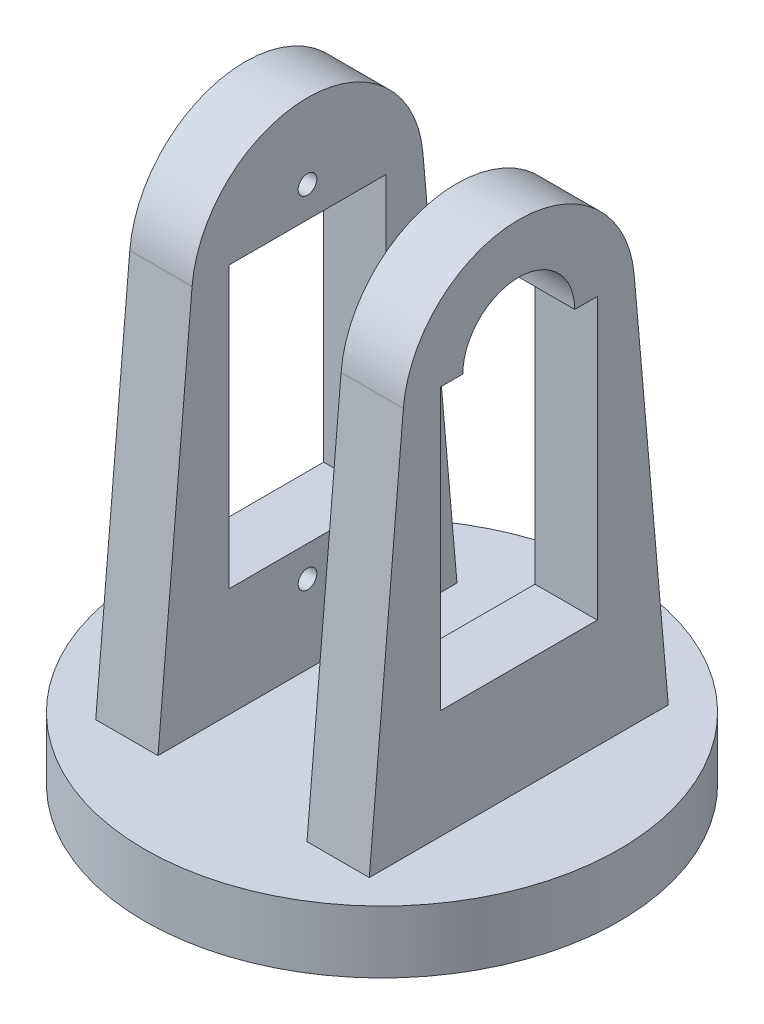
ISO-10303-21;
HEADER;
FILE_DESCRIPTION(('STEP AP214'),'2;1');
FILE_NAME('part.step','',(''),(''),'','','');
FILE_SCHEMA(('AUTOMOTIVE_DESIGN { 1 0 10303 214 1 1 1 1 }'));
ENDSEC;
DATA;
#1=APPLICATION_CONTEXT('core data for automotive mechanical design processes');
#2=APPLICATION_PROTOCOL_DEFINITION('international standard','automotive_design',2000,#1);
#3=PRODUCT_CONTEXT('',#1,'mechanical');
#4=PRODUCT('Part','Part','',(#3));
#5=PRODUCT_RELATED_PRODUCT_CATEGORY('part','',(#4));
#6=PRODUCT_DEFINITION_FORMATION('','',#4);
#7=PRODUCT_DEFINITION_CONTEXT('part definition',#1,'design');
#8=PRODUCT_DEFINITION('design','',#6,#7);
#9=PRODUCT_DEFINITION_SHAPE('','',#8);
#10=(LENGTH_UNIT() NAMED_UNIT(*) SI_UNIT(.MILLI.,.METRE.));
#11=(NAMED_UNIT(*) PLANE_ANGLE_UNIT() SI_UNIT($,.RADIAN.));
#12=(NAMED_UNIT(*) SI_UNIT($,.STERADIAN.) SOLID_ANGLE_UNIT());
#13=UNCERTAINTY_MEASURE_WITH_UNIT(LENGTH_MEASURE(1.E-05),#10,'distance_accuracy_value','');
#14=(GEOMETRIC_REPRESENTATION_CONTEXT(3) GLOBAL_UNCERTAINTY_ASSIGNED_CONTEXT((#13)) GLOBAL_UNIT_ASSIGNED_CONTEXT((#10,
#11,#12)) REPRESENTATION_CONTEXT('',''));
#15=CARTESIAN_POINT('',(0.,0.,0.));
#16=DIRECTION('',(0.,0.,1.));
#17=DIRECTION('',(1.,0.,0.));
#18=AXIS2_PLACEMENT_3D('',#15,#16,#17);
#19=CARTESIAN_POINT('',(5.98,36.25,-6.3));
#20=DIRECTION('',(0.,-1.,0.));
#21=DIRECTION('',(0.,0.,-1.));
#22=AXIS2_PLACEMENT_3D('',#19,#20,#21);
#23=PLANE('',#22);
#24=DIRECTION('',(-1.,0.,0.));
#25=VECTOR('',#24,1.);
#26=CARTESIAN_POINT('',(21.0215231185642,36.25,4.49070565814904));
#27=LINE('',#26,#25);
#28=CARTESIAN_POINT('',(10.98,36.25,4.49070565814904));
#29=VERTEX_POINT('',#28);
#30=CARTESIAN_POINT('',(5.98,36.25,4.49070565814904));
#31=VERTEX_POINT('',#30);
#32=EDGE_CURVE('E204',#29,#31,#27,.T.);
#33=ORIENTED_EDGE('',*,*,#32,.F.);
#34=DIRECTION('',(0.,0.,-1.));
#35=VECTOR('',#34,1.);
#36=CARTESIAN_POINT('',(10.98,36.25,-6.3));
#37=LINE('',#36,#35);
#38=CARTESIAN_POINT('',(10.98,36.25,6.3));
#39=VERTEX_POINT('',#38);
#40=EDGE_CURVE('E246',#39,#29,#37,.T.);
#41=ORIENTED_EDGE('',*,*,#40,.F.);
#42=DIRECTION('',(1.,0.,0.));
#43=VECTOR('',#42,1.);
#44=CARTESIAN_POINT('',(5.98,36.25,6.3));
#45=LINE('',#44,#43);
#46=CARTESIAN_POINT('',(5.98,36.25,6.3));
#47=VERTEX_POINT('',#46);
#48=EDGE_CURVE('E225',#47,#39,#45,.T.);
#49=ORIENTED_EDGE('',*,*,#48,.F.);
#50=DIRECTION('',(0.,0.,-1.));
#51=VECTOR('',#50,1.);
#52=CARTESIAN_POINT('',(5.98,36.25,-6.3));
#53=LINE('',#52,#51);
#54=EDGE_CURVE('E219',#47,#31,#53,.T.);
#55=ORIENTED_EDGE('',*,*,#54,.T.);
#56=EDGE_LOOP('',(#33,#41,#49,#55));
#57=FACE_BOUND('',#56,.T.);
#58=ADVANCED_FACE('F43',(#57),#23,.T.);
#59=CARTESIAN_POINT('',(0.,5.,0.));
#60=DIRECTION('',(0.,1.,0.));
#61=DIRECTION('',(0.,0.,1.));
#62=AXIS2_PLACEMENT_3D('',#59,#60,#61);
#63=PLANE('',#62);
#64=DIRECTION('',(0.,0.,1.));
#65=VECTOR('',#64,1.);
#66=CARTESIAN_POINT('',(-5.98,5.,-12.));
#67=LINE('',#66,#65);
#68=CARTESIAN_POINT('',(-5.98,5.,-12.));
#69=VERTEX_POINT('',#68);
#70=CARTESIAN_POINT('',(-5.98,5.,12.));
#71=VERTEX_POINT('',#70);
#72=EDGE_CURVE('E318',#69,#71,#67,.T.);
#73=ORIENTED_EDGE('',*,*,#72,.T.);
#74=DIRECTION('',(-1.,0.,0.));
#75=VECTOR('',#74,1.);
#76=CARTESIAN_POINT('',(-5.98,5.,12.));
#77=LINE('',#76,#75);
#78=CARTESIAN_POINT('',(-10.98,5.,12.));
#79=VERTEX_POINT('',#78);
#80=EDGE_CURVE('E343',#71,#79,#77,.T.);
#81=ORIENTED_EDGE('',*,*,#80,.T.);
#82=DIRECTION('',(0.,0.,1.));
#83=VECTOR('',#82,1.);
#84=CARTESIAN_POINT('',(-10.98,5.,-12.));
#85=LINE('',#84,#83);
#86=CARTESIAN_POINT('',(-10.98,5.,-12.));
#87=VERTEX_POINT('',#86);
#88=EDGE_CURVE('E330',#87,#79,#85,.T.);
#89=ORIENTED_EDGE('',*,*,#88,.F.);
#90=DIRECTION('',(-1.,0.,0.));
#91=VECTOR('',#90,1.);
#92=CARTESIAN_POINT('',(-5.98,5.,-12.));
#93=LINE('',#92,#91);
#94=EDGE_CURVE('E328',#69,#87,#93,.T.);
#95=ORIENTED_EDGE('',*,*,#94,.F.);
#96=EDGE_LOOP('',(#73,#81,#89,#95));
#97=FACE_BOUND('',#96,.T.);
#98=CARTESIAN_POINT('',(0.,5.,0.));
#99=DIRECTION('',(0.,1.,0.));
#100=DIRECTION('',(0.,0.,1.));
#101=AXIS2_PLACEMENT_3D('',#98,#99,#100);
#102=CIRCLE('',#101,19.05);
#103=CARTESIAN_POINT('',(0.,5.,19.05));
#104=VERTEX_POINT('',#103);
#105=EDGE_CURVE('E11',#104,#104,#102,.T.);
#106=ORIENTED_EDGE('',*,*,#105,.T.);
#107=EDGE_LOOP('',(#106));
#108=FACE_BOUND('',#107,.T.);
#109=CARTESIAN_POINT('',(0.,5.,0.));
#110=DIRECTION('',(0.,1.,0.));
#111=DIRECTION('',(0.,0.,1.));
#112=AXIS2_PLACEMENT_3D('',#109,#110,#111);
#113=CIRCLE('',#112,2.75);
#114=CARTESIAN_POINT('',(0.,5.,2.75));
#115=VERTEX_POINT('',#114);
#116=EDGE_CURVE('E392',#115,#115,#113,.T.);
#117=ORIENTED_EDGE('',*,*,#116,.F.);
#118=EDGE_LOOP('',(#117));
#119=FACE_BOUND('',#118,.T.);
#120=DIRECTION('',(0.,0.,1.));
#121=VECTOR('',#120,1.);
#122=CARTESIAN_POINT('',(5.98,5.,-12.));
#123=LINE('',#122,#121);
#124=CARTESIAN_POINT('',(5.98,5.,-12.));
#125=VERTEX_POINT('',#124);
#126=CARTESIAN_POINT('',(5.98,5.,12.));
#127=VERTEX_POINT('',#126);
#128=EDGE_CURVE('E261',#125,#127,#123,.T.);
#129=ORIENTED_EDGE('',*,*,#128,.F.);
#130=DIRECTION('',(1.,0.,0.));
#131=VECTOR('',#130,1.);
#132=CARTESIAN_POINT('',(5.98,5.,-12.));
#133=LINE('',#132,#131);
#134=CARTESIAN_POINT('',(10.98,5.,-12.));
#135=VERTEX_POINT('',#134);
#136=EDGE_CURVE('E272',#125,#135,#133,.T.);
#137=ORIENTED_EDGE('',*,*,#136,.T.);
#138=DIRECTION('',(0.,0.,1.));
#139=VECTOR('',#138,1.);
#140=CARTESIAN_POINT('',(10.98,5.,-12.));
#141=LINE('',#140,#139);
#142=CARTESIAN_POINT('',(10.98,5.,12.));
#143=VERTEX_POINT('',#142);
#144=EDGE_CURVE('E258',#135,#143,#141,.T.);
#145=ORIENTED_EDGE('',*,*,#144,.T.);
#146=DIRECTION('',(1.,0.,0.));
#147=VECTOR('',#146,1.);
#148=CARTESIAN_POINT('',(5.98,5.,12.));
#149=LINE('',#148,#147);
#150=EDGE_CURVE('E276',#127,#143,#149,.T.);
#151=ORIENTED_EDGE('',*,*,#150,.F.);
#152=EDGE_LOOP('',(#129,#137,#145,#151));
#153=FACE_BOUND('',#152,.T.);
#154=ADVANCED_FACE('F401',(#97,#108,#119,#153),#63,.T.);
#155=CARTESIAN_POINT('',(0.,0.,0.));
#156=DIRECTION('',(0.,1.,0.));
#157=DIRECTION('',(0.,0.,1.));
#158=AXIS2_PLACEMENT_3D('',#155,#156,#157);
#159=PLANE('',#158);
#160=CARTESIAN_POINT('',(0.,0.,0.));
#161=DIRECTION('',(0.,1.,0.));
#162=DIRECTION('',(0.,0.,1.));
#163=AXIS2_PLACEMENT_3D('',#160,#161,#162);
#164=CIRCLE('',#163,19.05);
#165=CARTESIAN_POINT('',(0.,0.,19.05));
#166=VERTEX_POINT('',#165);
#167=EDGE_CURVE('E52',#166,#166,#164,.T.);
#168=ORIENTED_EDGE('',*,*,#167,.F.);
#169=EDGE_LOOP('',(#168));
#170=FACE_BOUND('',#169,.T.);
#171=DIRECTION('',(-0.866025403784439,0.,-0.5));
#172=VECTOR('',#171,1.);
#173=CARTESIAN_POINT('',(4.02,0.,-2.3209480821423));
#174=LINE('',#173,#172);
#175=CARTESIAN_POINT('',(4.02,0.,-2.3209480821423));
#176=VERTEX_POINT('',#175);
#177=CARTESIAN_POINT('',(0.,0.,-4.64189616428459));
#178=VERTEX_POINT('',#177);
#179=EDGE_CURVE('E340',#176,#178,#174,.T.);
#180=ORIENTED_EDGE('',*,*,#179,.T.);
#181=DIRECTION('',(-0.866025403784439,0.,0.5));
#182=VECTOR('',#181,1.);
#183=CARTESIAN_POINT('',(0.,0.,-4.64189616428459));
#184=LINE('',#183,#182);
#185=CARTESIAN_POINT('',(-4.02,0.,-2.3209480821423));
#186=VERTEX_POINT('',#185);
#187=EDGE_CURVE('E365',#178,#186,#184,.T.);
#188=ORIENTED_EDGE('',*,*,#187,.T.);
#189=DIRECTION('',(0.,0.,1.));
#190=VECTOR('',#189,1.);
#191=CARTESIAN_POINT('',(-4.02,0.,-2.3209480821423));
#192=LINE('',#191,#190);
#193=CARTESIAN_POINT('',(-4.02,0.,2.32094808214229));
#194=VERTEX_POINT('',#193);
#195=EDGE_CURVE('E368',#186,#194,#192,.T.);
#196=ORIENTED_EDGE('',*,*,#195,.T.);
#197=DIRECTION('',(0.866025403784439,0.,0.5));
#198=VECTOR('',#197,1.);
#199=CARTESIAN_POINT('',(-4.02,0.,2.32094808214229));
#200=LINE('',#199,#198);
#201=CARTESIAN_POINT('',(0.,0.,4.64189616428459));
#202=VERTEX_POINT('',#201);
#203=EDGE_CURVE('E371',#194,#202,#200,.T.);
#204=ORIENTED_EDGE('',*,*,#203,.T.);
#205=DIRECTION('',(0.866025403784439,0.,-0.5));
#206=VECTOR('',#205,1.);
#207=CARTESIAN_POINT('',(0.,0.,4.64189616428459));
#208=LINE('',#207,#206);
#209=CARTESIAN_POINT('',(4.02,0.,2.3209480821423));
#210=VERTEX_POINT('',#209);
#211=EDGE_CURVE('E374',#202,#210,#208,.T.);
#212=ORIENTED_EDGE('',*,*,#211,.T.);
#213=DIRECTION('',(0.,0.,-1.));
#214=VECTOR('',#213,1.);
#215=CARTESIAN_POINT('',(4.02,0.,2.3209480821423));
#216=LINE('',#215,#214);
#217=EDGE_CURVE('E352',#210,#176,#216,.T.);
#218=ORIENTED_EDGE('',*,*,#217,.T.);
#219=EDGE_LOOP('',(#180,#188,#196,#204,#212,#218));
#220=FACE_BOUND('',#219,.T.);
#221=ADVANCED_FACE('F398',(#170,#220),#159,.F.);
#222=CARTESIAN_POINT('',(0.,5.,0.));
#223=DIRECTION('',(0.,-1.,0.));
#224=DIRECTION('',(0.,0.,-1.));
#225=AXIS2_PLACEMENT_3D('',#222,#223,#224);
#226=CYLINDRICAL_SURFACE('',#225,19.05);
#227=ORIENTED_EDGE('',*,*,#105,.F.);
#228=EDGE_LOOP('',(#227));
#229=FACE_BOUND('',#228,.T.);
#230=ORIENTED_EDGE('',*,*,#167,.T.);
#231=EDGE_LOOP('',(#230));
#232=FACE_BOUND('',#231,.T.);
#233=ADVANCED_FACE('F45',(#229,#232),#226,.T.);
#234=CARTESIAN_POINT('',(0.,5.,0.));
#235=DIRECTION('',(0.,-1.,0.));
#236=DIRECTION('',(0.,0.,-1.));
#237=AXIS2_PLACEMENT_3D('',#234,#235,#236);
#238=CYLINDRICAL_SURFACE('',#237,2.75);
#239=CARTESIAN_POINT('',(0.,4.1,0.));
#240=DIRECTION('',(0.,1.,0.));
#241=DIRECTION('',(0.,0.,1.));
#242=AXIS2_PLACEMENT_3D('',#239,#240,#241);
#243=CIRCLE('',#242,2.75);
#244=CARTESIAN_POINT('',(0.,4.1,2.75));
#245=VERTEX_POINT('',#244);
#246=EDGE_CURVE('E47',#245,#245,#243,.T.);
#247=ORIENTED_EDGE('',*,*,#246,.F.);
#248=EDGE_LOOP('',(#247));
#249=FACE_BOUND('',#248,.T.);
#250=ORIENTED_EDGE('',*,*,#116,.T.);
#251=EDGE_LOOP('',(#250));
#252=FACE_BOUND('',#251,.T.);
#253=ADVANCED_FACE('F551',(#249,#252),#238,.F.);
#254=CARTESIAN_POINT('',(4.02,4.1,-2.3209480821423));
#255=DIRECTION('',(-0.5,0.,0.866025403784439));
#256=DIRECTION('',(0.866025403784439,0.,0.5));
#257=AXIS2_PLACEMENT_3D('',#254,#255,#256);
#258=PLANE('',#257);
#259=ORIENTED_EDGE('',*,*,#179,.F.);
#260=DIRECTION('',(0.,-1.,0.));
#261=VECTOR('',#260,1.);
#262=CARTESIAN_POINT('',(4.02,4.1,-2.3209480821423));
#263=LINE('',#262,#261);
#264=CARTESIAN_POINT('',(4.02,4.1,-2.3209480821423));
#265=VERTEX_POINT('',#264);
#266=EDGE_CURVE('E362',#265,#176,#263,.T.);
#267=ORIENTED_EDGE('',*,*,#266,.F.);
#268=DIRECTION('',(-0.866025403784439,0.,-0.5));
#269=VECTOR('',#268,1.);
#270=CARTESIAN_POINT('',(4.02,4.1,-2.3209480821423));
#271=LINE('',#270,#269);
#272=CARTESIAN_POINT('',(0.,4.1,-4.64189616428459));
#273=VERTEX_POINT('',#272);
#274=EDGE_CURVE('E348',#265,#273,#271,.T.);
#275=ORIENTED_EDGE('',*,*,#274,.T.);
#276=DIRECTION('',(0.,-1.,0.));
#277=VECTOR('',#276,1.);
#278=CARTESIAN_POINT('',(0.,4.1,-4.64189616428459));
#279=LINE('',#278,#277);
#280=EDGE_CURVE('E389',#273,#178,#279,.T.);
#281=ORIENTED_EDGE('',*,*,#280,.T.);
#282=EDGE_LOOP('',(#259,#267,#275,#281));
#283=FACE_BOUND('',#282,.T.);
#284=ADVANCED_FACE('F405',(#283),#258,.T.);
#285=CARTESIAN_POINT('',(0.,4.1,-4.64189616428459));
#286=DIRECTION('',(0.5,0.,0.866025403784439));
#287=DIRECTION('',(0.866025403784439,0.,-0.5));
#288=AXIS2_PLACEMENT_3D('',#285,#286,#287);
#289=PLANE('',#288);
#290=ORIENTED_EDGE('',*,*,#187,.F.);
#291=ORIENTED_EDGE('',*,*,#280,.F.);
#292=DIRECTION('',(-0.866025403784439,0.,0.5));
#293=VECTOR('',#292,1.);
#294=CARTESIAN_POINT('',(0.,4.1,-4.64189616428459));
#295=LINE('',#294,#293);
#296=CARTESIAN_POINT('',(-4.02,4.1,-2.3209480821423));
#297=VERTEX_POINT('',#296);
#298=EDGE_CURVE('E351',#273,#297,#295,.T.);
#299=ORIENTED_EDGE('',*,*,#298,.T.);
#300=DIRECTION('',(0.,-1.,0.));
#301=VECTOR('',#300,1.);
#302=CARTESIAN_POINT('',(-4.02,4.1,-2.3209480821423));
#303=LINE('',#302,#301);
#304=EDGE_CURVE('E387',#297,#186,#303,.T.);
#305=ORIENTED_EDGE('',*,*,#304,.T.);
#306=EDGE_LOOP('',(#290,#291,#299,#305));
#307=FACE_BOUND('',#306,.T.);
#308=ADVANCED_FACE('F418',(#307),#289,.T.);
#309=CARTESIAN_POINT('',(-4.02,4.1,-2.3209480821423));
#310=DIRECTION('',(1.,0.,0.));
#311=DIRECTION('',(0.,0.,-1.));
#312=AXIS2_PLACEMENT_3D('',#309,#310,#311);
#313=PLANE('',#312);
#314=ORIENTED_EDGE('',*,*,#195,.F.);
#315=ORIENTED_EDGE('',*,*,#304,.F.);
#316=DIRECTION('',(0.,0.,1.));
#317=VECTOR('',#316,1.);
#318=CARTESIAN_POINT('',(-4.02,4.1,-2.3209480821423));
#319=LINE('',#318,#317);
#320=CARTESIAN_POINT('',(-4.02,4.1,2.32094808214229));
#321=VERTEX_POINT('',#320);
#322=EDGE_CURVE('E354',#297,#321,#319,.T.);
#323=ORIENTED_EDGE('',*,*,#322,.T.);
#324=DIRECTION('',(0.,-1.,0.));
#325=VECTOR('',#324,1.);
#326=CARTESIAN_POINT('',(-4.02,4.1,2.32094808214229));
#327=LINE('',#326,#325);
#328=EDGE_CURVE('E385',#321,#194,#327,.T.);
#329=ORIENTED_EDGE('',*,*,#328,.T.);
#330=EDGE_LOOP('',(#314,#315,#323,#329));
#331=FACE_BOUND('',#330,.T.);
#332=ADVANCED_FACE('F422',(#331),#313,.T.);
#333=CARTESIAN_POINT('',(-4.02,4.1,2.32094808214229));
#334=DIRECTION('',(0.5,0.,-0.866025403784439));
#335=DIRECTION('',(-0.866025403784439,0.,-0.5));
#336=AXIS2_PLACEMENT_3D('',#333,#334,#335);
#337=PLANE('',#336);
#338=ORIENTED_EDGE('',*,*,#203,.F.);
#339=ORIENTED_EDGE('',*,*,#328,.F.);
#340=DIRECTION('',(0.866025403784439,0.,0.5));
#341=VECTOR('',#340,1.);
#342=CARTESIAN_POINT('',(-4.02,4.1,2.32094808214229));
#343=LINE('',#342,#341);
#344=CARTESIAN_POINT('',(0.,4.1,4.64189616428459));
#345=VERTEX_POINT('',#344);
#346=EDGE_CURVE('E356',#321,#345,#343,.T.);
#347=ORIENTED_EDGE('',*,*,#346,.T.);
#348=DIRECTION('',(0.,-1.,0.));
#349=VECTOR('',#348,1.);
#350=CARTESIAN_POINT('',(0.,4.1,4.64189616428459));
#351=LINE('',#350,#349);
#352=EDGE_CURVE('E383',#345,#202,#351,.T.);
#353=ORIENTED_EDGE('',*,*,#352,.T.);
#354=EDGE_LOOP('',(#338,#339,#347,#353));
#355=FACE_BOUND('',#354,.T.);
#356=ADVANCED_FACE('F427',(#355),#337,.T.);
#357=CARTESIAN_POINT('',(0.,4.1,4.64189616428459));
#358=DIRECTION('',(-0.5,0.,-0.866025403784439));
#359=DIRECTION('',(-0.866025403784439,0.,0.5));
#360=AXIS2_PLACEMENT_3D('',#357,#358,#359);
#361=PLANE('',#360);
#362=ORIENTED_EDGE('',*,*,#211,.F.);
#363=ORIENTED_EDGE('',*,*,#352,.F.);
#364=DIRECTION('',(0.866025403784439,0.,-0.5));
#365=VECTOR('',#364,1.);
#366=CARTESIAN_POINT('',(0.,4.1,4.64189616428459));
#367=LINE('',#366,#365);
#368=CARTESIAN_POINT('',(4.02,4.1,2.3209480821423));
#369=VERTEX_POINT('',#368);
#370=EDGE_CURVE('E358',#345,#369,#367,.T.);
#371=ORIENTED_EDGE('',*,*,#370,.T.);
#372=DIRECTION('',(0.,-1.,0.));
#373=VECTOR('',#372,1.);
#374=CARTESIAN_POINT('',(4.02,4.1,2.3209480821423));
#375=LINE('',#374,#373);
#376=EDGE_CURVE('E381',#369,#210,#375,.T.);
#377=ORIENTED_EDGE('',*,*,#376,.T.);
#378=EDGE_LOOP('',(#362,#363,#371,#377));
#379=FACE_BOUND('',#378,.T.);
#380=ADVANCED_FACE('F430',(#379),#361,.T.);
#381=CARTESIAN_POINT('',(4.02,4.1,2.3209480821423));
#382=DIRECTION('',(-1.,0.,0.));
#383=DIRECTION('',(0.,0.,1.));
#384=AXIS2_PLACEMENT_3D('',#381,#382,#383);
#385=PLANE('',#384);
#386=ORIENTED_EDGE('',*,*,#217,.F.);
#387=ORIENTED_EDGE('',*,*,#376,.F.);
#388=DIRECTION('',(0.,0.,-1.));
#389=VECTOR('',#388,1.);
#390=CARTESIAN_POINT('',(4.02,4.1,2.3209480821423));
#391=LINE('',#390,#389);
#392=EDGE_CURVE('E360',#369,#265,#391,.T.);
#393=ORIENTED_EDGE('',*,*,#392,.T.);
#394=ORIENTED_EDGE('',*,*,#266,.T.);
#395=EDGE_LOOP('',(#386,#387,#393,#394));
#396=FACE_BOUND('',#395,.T.);
#397=ADVANCED_FACE('F409',(#396),#385,.T.);
#398=CARTESIAN_POINT('',(0.,4.1,0.));
#399=DIRECTION('',(0.,1.,0.));
#400=DIRECTION('',(0.,0.,1.));
#401=AXIS2_PLACEMENT_3D('',#398,#399,#400);
#402=PLANE('',#401);
#403=ORIENTED_EDGE('',*,*,#246,.T.);
#404=EDGE_LOOP('',(#403));
#405=FACE_BOUND('',#404,.T.);
#406=ORIENTED_EDGE('',*,*,#274,.F.);
#407=ORIENTED_EDGE('',*,*,#392,.F.);
#408=ORIENTED_EDGE('',*,*,#370,.F.);
#409=ORIENTED_EDGE('',*,*,#346,.F.);
#410=ORIENTED_EDGE('',*,*,#322,.F.);
#411=ORIENTED_EDGE('',*,*,#298,.F.);
#412=EDGE_LOOP('',(#406,#407,#408,#409,#410,#411));
#413=FACE_BOUND('',#412,.T.);
#414=ADVANCED_FACE('F414',(#405,#413),#402,.F.);
#415=CARTESIAN_POINT('',(-5.98,5.,-12.));
#416=DIRECTION('',(0.,0.087155742747654,-0.996194698091746));
#417=DIRECTION('',(0.,0.996194698091746,0.087155742747654));
#418=AXIS2_PLACEMENT_3D('',#415,#416,#417);
#419=PLANE('',#418);
#420=DIRECTION('',(0.,-0.996194698091746,-0.087155742747654));
#421=VECTOR('',#420,1.);
#422=CARTESIAN_POINT('',(-10.98,5.,-12.));
#423=LINE('',#422,#421);
#424=CARTESIAN_POINT('',(-10.98,36.25,-9.265979264815));
#425=VERTEX_POINT('',#424);
#426=EDGE_CURVE('E308',#425,#87,#423,.T.);
#427=ORIENTED_EDGE('',*,*,#426,.F.);
#428=DIRECTION('',(-1.,0.,0.));
#429=VECTOR('',#428,1.);
#430=CARTESIAN_POINT('',(-5.98,36.25,-9.265979264815));
#431=LINE('',#430,#429);
#432=CARTESIAN_POINT('',(-5.98,36.25,-9.265979264815));
#433=VERTEX_POINT('',#432);
#434=EDGE_CURVE('E338',#433,#425,#431,.T.);
#435=ORIENTED_EDGE('',*,*,#434,.F.);
#436=DIRECTION('',(0.,-0.996194698091746,-0.087155742747654));
#437=VECTOR('',#436,1.);
#438=CARTESIAN_POINT('',(-5.98,5.,-12.));
#439=LINE('',#438,#437);
#440=EDGE_CURVE('E315',#433,#69,#439,.T.);
#441=ORIENTED_EDGE('',*,*,#440,.T.);
#442=ORIENTED_EDGE('',*,*,#94,.T.);
#443=EDGE_LOOP('',(#427,#435,#441,#442));
#444=FACE_BOUND('',#443,.T.);
#445=ADVANCED_FACE('F536',(#444),#419,.T.);
#446=CARTESIAN_POINT('',(-5.98,35.4393318578624,0.));
#447=DIRECTION('',(-1.,0.,0.));
#448=DIRECTION('',(0.,0.,1.));
#449=AXIS2_PLACEMENT_3D('',#446,#447,#448);
#450=CYLINDRICAL_SURFACE('',#449,9.30137380028662);
#451=CARTESIAN_POINT('',(-10.98,35.4393318578624,0.));
#452=DIRECTION('',(-1.,0.,0.));
#453=DIRECTION('',(0.,0.,-1.));
#454=AXIS2_PLACEMENT_3D('',#451,#452,#453);
#455=CIRCLE('',#454,9.30137380028662);
#456=CARTESIAN_POINT('',(-10.98,36.25,9.26597926481499));
#457=VERTEX_POINT('',#456);
#458=EDGE_CURVE('E319',#457,#425,#455,.T.);
#459=ORIENTED_EDGE('',*,*,#458,.F.);
#460=DIRECTION('',(-1.,0.,0.));
#461=VECTOR('',#460,1.);
#462=CARTESIAN_POINT('',(-5.98,36.25,9.26597926481499));
#463=LINE('',#462,#461);
#464=CARTESIAN_POINT('',(-5.98,36.25,9.26597926481499));
#465=VERTEX_POINT('',#464);
#466=EDGE_CURVE('E341',#465,#457,#463,.T.);
#467=ORIENTED_EDGE('',*,*,#466,.F.);
#468=CARTESIAN_POINT('',(-5.98,35.4393318578624,0.));
#469=DIRECTION('',(-1.,0.,0.));
#470=DIRECTION('',(0.,0.,-1.));
#471=AXIS2_PLACEMENT_3D('',#468,#469,#470);
#472=CIRCLE('',#471,9.30137380028662);
#473=EDGE_CURVE('E325',#465,#433,#472,.T.);
#474=ORIENTED_EDGE('',*,*,#473,.T.);
#475=ORIENTED_EDGE('',*,*,#434,.T.);
#476=EDGE_LOOP('',(#459,#467,#474,#475));
#477=FACE_BOUND('',#476,.T.);
#478=ADVANCED_FACE('F533',(#477),#450,.T.);
#479=CARTESIAN_POINT('',(-5.98,5.,12.));
#480=DIRECTION('',(0.,0.0871557427476544,0.996194698091746));
#481=DIRECTION('',(0.,-0.996194698091746,0.0871557427476544));
#482=AXIS2_PLACEMENT_3D('',#479,#480,#481);
#483=PLANE('',#482);
#484=DIRECTION('',(0.,0.996194698091746,-0.0871557427476544));
#485=VECTOR('',#484,1.);
#486=CARTESIAN_POINT('',(-10.98,5.,12.));
#487=LINE('',#486,#485);
#488=EDGE_CURVE('E333',#79,#457,#487,.T.);
#489=ORIENTED_EDGE('',*,*,#488,.F.);
#490=ORIENTED_EDGE('',*,*,#80,.F.);
#491=DIRECTION('',(0.,0.996194698091746,-0.0871557427476544));
#492=VECTOR('',#491,1.);
#493=CARTESIAN_POINT('',(-5.98,5.,12.));
#494=LINE('',#493,#492);
#495=EDGE_CURVE('E322',#71,#465,#494,.T.);
#496=ORIENTED_EDGE('',*,*,#495,.T.);
#497=ORIENTED_EDGE('',*,*,#466,.T.);
#498=EDGE_LOOP('',(#489,#490,#496,#497));
#499=FACE_BOUND('',#498,.T.);
#500=ADVANCED_FACE('F528',(#499),#483,.T.);
#501=CARTESIAN_POINT('',(-5.98,35.4393318578624,0.));
#502=DIRECTION('',(1.,0.,0.));
#503=DIRECTION('',(0.,0.,-1.));
#504=AXIS2_PLACEMENT_3D('',#501,#502,#503);
#505=PLANE('',#504);
#506=CARTESIAN_POINT('',(-5.98,38.7159998342392,0.));
#507=DIRECTION('',(1.,0.,0.));
#508=DIRECTION('',(0.,0.,-1.));
#509=AXIS2_PLACEMENT_3D('',#506,#507,#508);
#510=CIRCLE('',#509,0.750000000000154);
#511=CARTESIAN_POINT('',(-5.98,38.7159998342392,-0.750000000000231));
#512=VERTEX_POINT('',#511);
#513=EDGE_CURVE('E239',#512,#512,#510,.F.);
#514=ORIENTED_EDGE('',*,*,#513,.T.);
#515=EDGE_LOOP('',(#514));
#516=FACE_BOUND('',#515,.T.);
#517=CARTESIAN_POINT('',(-5.98,11.2840001657607,0.));
#518=DIRECTION('',(1.,0.,0.));
#519=DIRECTION('',(0.,0.,-1.));
#520=AXIS2_PLACEMENT_3D('',#517,#518,#519);
#521=CIRCLE('',#520,0.75);
#522=CARTESIAN_POINT('',(-5.98,11.2840001657607,-0.749999999999953));
#523=VERTEX_POINT('',#522);
#524=EDGE_CURVE('E476',#523,#523,#521,.F.);
#525=ORIENTED_EDGE('',*,*,#524,.T.);
#526=EDGE_LOOP('',(#525));
#527=FACE_BOUND('',#526,.T.);
#528=DIRECTION('',(0.,1.,0.));
#529=VECTOR('',#528,1.);
#530=CARTESIAN_POINT('',(-5.98,13.75,6.3));
#531=LINE('',#530,#529);
#532=CARTESIAN_POINT('',(-5.98,13.75,6.3));
#533=VERTEX_POINT('',#532);
#534=CARTESIAN_POINT('',(-5.98,36.25,6.3));
#535=VERTEX_POINT('',#534);
#536=EDGE_CURVE('E283',#533,#535,#531,.T.);
#537=ORIENTED_EDGE('',*,*,#536,.T.);
#538=DIRECTION('',(0.,0.,-1.));
#539=VECTOR('',#538,1.);
#540=CARTESIAN_POINT('',(-5.98,36.25,-6.3));
#541=LINE('',#540,#539);
#542=CARTESIAN_POINT('',(-5.98,36.25,-6.3));
#543=VERTEX_POINT('',#542);
#544=EDGE_CURVE('E286',#535,#543,#541,.T.);
#545=ORIENTED_EDGE('',*,*,#544,.T.);
#546=DIRECTION('',(0.,-1.,0.));
#547=VECTOR('',#546,1.);
#548=CARTESIAN_POINT('',(-5.98,13.75,-6.3));
#549=LINE('',#548,#547);
#550=CARTESIAN_POINT('',(-5.98,13.75,-6.3));
#551=VERTEX_POINT('',#550);
#552=EDGE_CURVE('E290',#543,#551,#549,.T.);
#553=ORIENTED_EDGE('',*,*,#552,.T.);
#554=DIRECTION('',(0.,0.,1.));
#555=VECTOR('',#554,1.);
#556=CARTESIAN_POINT('',(-5.98,13.75,-6.3));
#557=LINE('',#556,#555);
#558=EDGE_CURVE('E293',#551,#533,#557,.T.);
#559=ORIENTED_EDGE('',*,*,#558,.T.);
#560=EDGE_LOOP('',(#537,#545,#553,#559));
#561=FACE_BOUND('',#560,.T.);
#562=ORIENTED_EDGE('',*,*,#440,.F.);
#563=ORIENTED_EDGE('',*,*,#473,.F.);
#564=ORIENTED_EDGE('',*,*,#495,.F.);
#565=ORIENTED_EDGE('',*,*,#72,.F.);
#566=EDGE_LOOP('',(#562,#563,#564,#565));
#567=FACE_BOUND('',#566,.T.);
#568=ADVANCED_FACE('F525',(#516,#527,#561,#567),#505,.T.);
#569=CARTESIAN_POINT('',(-10.98,35.4393318578624,0.));
#570=DIRECTION('',(1.,0.,0.));
#571=DIRECTION('',(0.,0.,-1.));
#572=AXIS2_PLACEMENT_3D('',#569,#570,#571);
#573=PLANE('',#572);
#574=CARTESIAN_POINT('',(-10.98,38.7159998342392,0.));
#575=DIRECTION('',(-1.,0.,0.));
#576=DIRECTION('',(0.,0.,1.));
#577=AXIS2_PLACEMENT_3D('',#574,#575,#576);
#578=CIRCLE('',#577,0.750000000000154);
#579=CARTESIAN_POINT('',(-10.98,38.7159998342392,0.750000000000076));
#580=VERTEX_POINT('',#579);
#581=EDGE_CURVE('E470',#580,#580,#578,.T.);
#582=ORIENTED_EDGE('',*,*,#581,.F.);
#583=EDGE_LOOP('',(#582));
#584=FACE_BOUND('',#583,.T.);
#585=CARTESIAN_POINT('',(-10.98,11.2840001657607,0.));
#586=DIRECTION('',(-1.,0.,0.));
#587=DIRECTION('',(0.,0.,1.));
#588=AXIS2_PLACEMENT_3D('',#585,#586,#587);
#589=CIRCLE('',#588,0.75);
#590=CARTESIAN_POINT('',(-10.98,11.2840001657607,0.750000000000047));
#591=VERTEX_POINT('',#590);
#592=EDGE_CURVE('E473',#591,#591,#589,.T.);
#593=ORIENTED_EDGE('',*,*,#592,.F.);
#594=EDGE_LOOP('',(#593));
#595=FACE_BOUND('',#594,.T.);
#596=DIRECTION('',(0.,0.,-1.));
#597=VECTOR('',#596,1.);
#598=CARTESIAN_POINT('',(-10.98,36.25,-6.3));
#599=LINE('',#598,#597);
#600=CARTESIAN_POINT('',(-10.98,36.25,6.3));
#601=VERTEX_POINT('',#600);
#602=CARTESIAN_POINT('',(-10.98,36.25,-6.3));
#603=VERTEX_POINT('',#602);
#604=EDGE_CURVE('E298',#601,#603,#599,.T.);
#605=ORIENTED_EDGE('',*,*,#604,.F.);
#606=DIRECTION('',(0.,1.,0.));
#607=VECTOR('',#606,1.);
#608=CARTESIAN_POINT('',(-10.98,13.75,6.3));
#609=LINE('',#608,#607);
#610=CARTESIAN_POINT('',(-10.98,13.75,6.3));
#611=VERTEX_POINT('',#610);
#612=EDGE_CURVE('E275',#611,#601,#609,.T.);
#613=ORIENTED_EDGE('',*,*,#612,.F.);
#614=DIRECTION('',(0.,0.,1.));
#615=VECTOR('',#614,1.);
#616=CARTESIAN_POINT('',(-10.98,13.75,-6.3));
#617=LINE('',#616,#615);
#618=CARTESIAN_POINT('',(-10.98,13.75,-6.3));
#619=VERTEX_POINT('',#618);
#620=EDGE_CURVE('E287',#619,#611,#617,.T.);
#621=ORIENTED_EDGE('',*,*,#620,.F.);
#622=DIRECTION('',(0.,-1.,0.));
#623=VECTOR('',#622,1.);
#624=CARTESIAN_POINT('',(-10.98,13.75,-6.3));
#625=LINE('',#624,#623);
#626=EDGE_CURVE('E301',#603,#619,#625,.T.);
#627=ORIENTED_EDGE('',*,*,#626,.F.);
#628=EDGE_LOOP('',(#605,#613,#621,#627));
#629=FACE_BOUND('',#628,.T.);
#630=ORIENTED_EDGE('',*,*,#426,.T.);
#631=ORIENTED_EDGE('',*,*,#88,.T.);
#632=ORIENTED_EDGE('',*,*,#488,.T.);
#633=ORIENTED_EDGE('',*,*,#458,.T.);
#634=EDGE_LOOP('',(#630,#631,#632,#633));
#635=FACE_BOUND('',#634,.T.);
#636=ADVANCED_FACE('F523',(#584,#595,#629,#635),#573,.F.);
#637=CARTESIAN_POINT('',(-5.98,13.75,6.3));
#638=DIRECTION('',(0.,0.,1.));
#639=DIRECTION('',(1.,0.,0.));
#640=AXIS2_PLACEMENT_3D('',#637,#638,#639);
#641=PLANE('',#640);
#642=ORIENTED_EDGE('',*,*,#612,.T.);
#643=DIRECTION('',(-1.,0.,0.));
#644=VECTOR('',#643,1.);
#645=CARTESIAN_POINT('',(-5.98,36.25,6.3));
#646=LINE('',#645,#644);
#647=EDGE_CURVE('E296',#535,#601,#646,.T.);
#648=ORIENTED_EDGE('',*,*,#647,.F.);
#649=ORIENTED_EDGE('',*,*,#536,.F.);
#650=DIRECTION('',(-1.,0.,0.));
#651=VECTOR('',#650,1.);
#652=CARTESIAN_POINT('',(-5.98,13.75,6.3));
#653=LINE('',#652,#651);
#654=EDGE_CURVE('E306',#533,#611,#653,.T.);
#655=ORIENTED_EDGE('',*,*,#654,.T.);
#656=EDGE_LOOP('',(#642,#648,#649,#655));
#657=FACE_BOUND('',#656,.T.);
#658=ADVANCED_FACE('F513',(#657),#641,.F.);
#659=CARTESIAN_POINT('',(-5.98,13.75,-6.3));
#660=DIRECTION('',(0.,-1.,0.));
#661=DIRECTION('',(0.,0.,-1.));
#662=AXIS2_PLACEMENT_3D('',#659,#660,#661);
#663=PLANE('',#662);
#664=ORIENTED_EDGE('',*,*,#620,.T.);
#665=ORIENTED_EDGE('',*,*,#654,.F.);
#666=ORIENTED_EDGE('',*,*,#558,.F.);
#667=DIRECTION('',(-1.,0.,0.));
#668=VECTOR('',#667,1.);
#669=CARTESIAN_POINT('',(-5.98,13.75,-6.3));
#670=LINE('',#669,#668);
#671=EDGE_CURVE('E309',#551,#619,#670,.T.);
#672=ORIENTED_EDGE('',*,*,#671,.T.);
#673=EDGE_LOOP('',(#664,#665,#666,#672));
#674=FACE_BOUND('',#673,.T.);
#675=ADVANCED_FACE('F509',(#674),#663,.F.);
#676=CARTESIAN_POINT('',(-5.98,13.75,-6.3));
#677=DIRECTION('',(0.,0.,-1.));
#678=DIRECTION('',(-1.,0.,0.));
#679=AXIS2_PLACEMENT_3D('',#676,#677,#678);
#680=PLANE('',#679);
#681=ORIENTED_EDGE('',*,*,#626,.T.);
#682=ORIENTED_EDGE('',*,*,#671,.F.);
#683=ORIENTED_EDGE('',*,*,#552,.F.);
#684=DIRECTION('',(-1.,0.,0.));
#685=VECTOR('',#684,1.);
#686=CARTESIAN_POINT('',(-5.98,36.25,-6.3));
#687=LINE('',#686,#685);
#688=EDGE_CURVE('E311',#543,#603,#687,.T.);
#689=ORIENTED_EDGE('',*,*,#688,.T.);
#690=EDGE_LOOP('',(#681,#682,#683,#689));
#691=FACE_BOUND('',#690,.T.);
#692=ADVANCED_FACE('F512',(#691),#680,.F.);
#693=CARTESIAN_POINT('',(-5.98,36.25,-6.3));
#694=DIRECTION('',(0.,1.,0.));
#695=DIRECTION('',(0.,0.,1.));
#696=AXIS2_PLACEMENT_3D('',#693,#694,#695);
#697=PLANE('',#696);
#698=ORIENTED_EDGE('',*,*,#604,.T.);
#699=ORIENTED_EDGE('',*,*,#688,.F.);
#700=ORIENTED_EDGE('',*,*,#544,.F.);
#701=ORIENTED_EDGE('',*,*,#647,.T.);
#702=EDGE_LOOP('',(#698,#699,#700,#701));
#703=FACE_BOUND('',#702,.T.);
#704=ADVANCED_FACE('F500',(#703),#697,.F.);
#705=CARTESIAN_POINT('',(5.98,35.4393318578624,0.));
#706=DIRECTION('',(-1.,0.,0.));
#707=DIRECTION('',(0.,0.,-1.));
#708=AXIS2_PLACEMENT_3D('',#705,#706,#707);
#709=PLANE('',#708);
#710=CARTESIAN_POINT('',(5.98,36.25,0.));
#711=DIRECTION('',(-1.,0.,0.));
#712=DIRECTION('',(0.,0.,1.));
#713=AXIS2_PLACEMENT_3D('',#710,#711,#712);
#714=CIRCLE('',#713,4.49070565814904);
#715=CARTESIAN_POINT('',(5.98,36.25,-4.49070565814904));
#716=VERTEX_POINT('',#715);
#717=EDGE_CURVE('E60',#31,#716,#714,.T.);
#718=ORIENTED_EDGE('',*,*,#717,.F.);
#719=ORIENTED_EDGE('',*,*,#54,.F.);
#720=DIRECTION('',(0.,1.,0.));
#721=VECTOR('',#720,1.);
#722=CARTESIAN_POINT('',(5.98,13.75,6.3));
#723=LINE('',#722,#721);
#724=CARTESIAN_POINT('',(5.98,13.75,6.3));
#725=VERTEX_POINT('',#724);
#726=EDGE_CURVE('E248',#725,#47,#723,.T.);
#727=ORIENTED_EDGE('',*,*,#726,.F.);
#728=DIRECTION('',(0.,0.,1.));
#729=VECTOR('',#728,1.);
#730=CARTESIAN_POINT('',(5.98,13.75,-6.3));
#731=LINE('',#730,#729);
#732=CARTESIAN_POINT('',(5.98,13.75,-6.3));
#733=VERTEX_POINT('',#732);
#734=EDGE_CURVE('E481',#733,#725,#731,.T.);
#735=ORIENTED_EDGE('',*,*,#734,.F.);
#736=DIRECTION('',(0.,-1.,0.));
#737=VECTOR('',#736,1.);
#738=CARTESIAN_POINT('',(5.98,13.75,-6.3));
#739=LINE('',#738,#737);
#740=CARTESIAN_POINT('',(5.98,36.25,-6.3));
#741=VERTEX_POINT('',#740);
#742=EDGE_CURVE('E231',#741,#733,#739,.T.);
#743=ORIENTED_EDGE('',*,*,#742,.F.);
#744=EDGE_CURVE('E221',#716,#741,#53,.T.);
#745=ORIENTED_EDGE('',*,*,#744,.F.);
#746=EDGE_LOOP('',(#718,#719,#727,#735,#743,#745));
#747=FACE_BOUND('',#746,.T.);
#748=DIRECTION('',(0.,-0.996194698091746,-0.087155742747654));
#749=VECTOR('',#748,1.);
#750=CARTESIAN_POINT('',(5.98,5.,-12.));
#751=LINE('',#750,#749);
#752=CARTESIAN_POINT('',(5.98,36.25,-9.265979264815));
#753=VERTEX_POINT('',#752);
#754=EDGE_CURVE('E255',#753,#125,#751,.T.);
#755=ORIENTED_EDGE('',*,*,#754,.T.);
#756=ORIENTED_EDGE('',*,*,#128,.T.);
#757=DIRECTION('',(0.,0.996194698091746,-0.0871557427476544));
#758=VECTOR('',#757,1.);
#759=CARTESIAN_POINT('',(5.98,5.,12.));
#760=LINE('',#759,#758);
#761=CARTESIAN_POINT('',(5.98,36.25,9.26597926481499));
#762=VERTEX_POINT('',#761);
#763=EDGE_CURVE('E68',#127,#762,#760,.T.);
#764=ORIENTED_EDGE('',*,*,#763,.T.);
#765=CARTESIAN_POINT('',(5.98,35.4393318578624,0.));
#766=DIRECTION('',(-1.,0.,0.));
#767=DIRECTION('',(0.,0.,-1.));
#768=AXIS2_PLACEMENT_3D('',#765,#766,#767);
#769=CIRCLE('',#768,9.30137380028662);
#770=EDGE_CURVE('E257',#762,#753,#769,.T.);
#771=ORIENTED_EDGE('',*,*,#770,.T.);
#772=EDGE_LOOP('',(#755,#756,#764,#771));
#773=FACE_BOUND('',#772,.T.);
#774=ADVANCED_FACE('F216',(#747,#773),#709,.T.);
#775=CARTESIAN_POINT('',(10.98,35.4393318578624,0.));
#776=DIRECTION('',(-1.,0.,0.));
#777=DIRECTION('',(0.,0.,-1.));
#778=AXIS2_PLACEMENT_3D('',#775,#776,#777);
#779=PLANE('',#778);
#780=DIRECTION('',(0.,-0.996194698091746,-0.087155742747654));
#781=VECTOR('',#780,1.);
#782=CARTESIAN_POINT('',(10.98,5.,-12.));
#783=LINE('',#782,#781);
#784=CARTESIAN_POINT('',(10.98,36.25,-9.265979264815));
#785=VERTEX_POINT('',#784);
#786=EDGE_CURVE('E250',#785,#135,#783,.T.);
#787=ORIENTED_EDGE('',*,*,#786,.F.);
#788=CARTESIAN_POINT('',(10.98,35.4393318578624,0.));
#789=DIRECTION('',(-1.,0.,0.));
#790=DIRECTION('',(0.,0.,-1.));
#791=AXIS2_PLACEMENT_3D('',#788,#789,#790);
#792=CIRCLE('',#791,9.30137380028662);
#793=CARTESIAN_POINT('',(10.98,36.25,9.26597926481499));
#794=VERTEX_POINT('',#793);
#795=EDGE_CURVE('E266',#794,#785,#792,.T.);
#796=ORIENTED_EDGE('',*,*,#795,.F.);
#797=DIRECTION('',(0.,0.996194698091746,-0.0871557427476544));
#798=VECTOR('',#797,1.);
#799=CARTESIAN_POINT('',(10.98,5.,12.));
#800=LINE('',#799,#798);
#801=EDGE_CURVE('E268',#143,#794,#800,.T.);
#802=ORIENTED_EDGE('',*,*,#801,.F.);
#803=ORIENTED_EDGE('',*,*,#144,.F.);
#804=EDGE_LOOP('',(#787,#796,#802,#803));
#805=FACE_BOUND('',#804,.T.);
#806=ORIENTED_EDGE('',*,*,#40,.T.);
#807=CARTESIAN_POINT('',(10.98,36.25,0.));
#808=DIRECTION('',(-1.,0.,0.));
#809=DIRECTION('',(0.,0.,1.));
#810=AXIS2_PLACEMENT_3D('',#807,#808,#809);
#811=CIRCLE('',#810,4.49070565814904);
#812=CARTESIAN_POINT('',(10.98,36.25,-4.49070565814904));
#813=VERTEX_POINT('',#812);
#814=EDGE_CURVE('E207',#813,#29,#811,.F.);
#815=ORIENTED_EDGE('',*,*,#814,.F.);
#816=CARTESIAN_POINT('',(10.98,36.25,-6.3));
#817=VERTEX_POINT('',#816);
#818=EDGE_CURVE('E245',#813,#817,#37,.T.);
#819=ORIENTED_EDGE('',*,*,#818,.T.);
#820=DIRECTION('',(0.,-1.,0.));
#821=VECTOR('',#820,1.);
#822=CARTESIAN_POINT('',(10.98,13.75,-6.3));
#823=LINE('',#822,#821);
#824=CARTESIAN_POINT('',(10.98,13.75,-6.3));
#825=VERTEX_POINT('',#824);
#826=EDGE_CURVE('E242',#817,#825,#823,.T.);
#827=ORIENTED_EDGE('',*,*,#826,.T.);
#828=DIRECTION('',(0.,0.,1.));
#829=VECTOR('',#828,1.);
#830=CARTESIAN_POINT('',(10.98,13.75,-6.3));
#831=LINE('',#830,#829);
#832=CARTESIAN_POINT('',(10.98,13.75,6.3));
#833=VERTEX_POINT('',#832);
#834=EDGE_CURVE('E238',#825,#833,#831,.T.);
#835=ORIENTED_EDGE('',*,*,#834,.T.);
#836=DIRECTION('',(0.,1.,0.));
#837=VECTOR('',#836,1.);
#838=CARTESIAN_POINT('',(10.98,13.75,6.3));
#839=LINE('',#838,#837);
#840=EDGE_CURVE('E235',#833,#39,#839,.T.);
#841=ORIENTED_EDGE('',*,*,#840,.T.);
#842=EDGE_LOOP('',(#806,#815,#819,#827,#835,#841));
#843=FACE_BOUND('',#842,.T.);
#844=ADVANCED_FACE('F489',(#805,#843),#779,.F.);
#845=CARTESIAN_POINT('',(5.98,5.,-12.));
#846=DIRECTION('',(0.,-0.087155742747654,0.996194698091746));
#847=DIRECTION('',(0.,-0.996194698091746,-0.087155742747654));
#848=AXIS2_PLACEMENT_3D('',#845,#846,#847);
#849=PLANE('',#848);
#850=ORIENTED_EDGE('',*,*,#786,.T.);
#851=ORIENTED_EDGE('',*,*,#136,.F.);
#852=ORIENTED_EDGE('',*,*,#754,.F.);
#853=DIRECTION('',(1.,0.,0.));
#854=VECTOR('',#853,1.);
#855=CARTESIAN_POINT('',(5.98,36.25,-9.265979264815));
#856=LINE('',#855,#854);
#857=EDGE_CURVE('E263',#753,#785,#856,.T.);
#858=ORIENTED_EDGE('',*,*,#857,.T.);
#859=EDGE_LOOP('',(#850,#851,#852,#858));
#860=FACE_BOUND('',#859,.T.);
#861=ADVANCED_FACE('F491',(#860),#849,.F.);
#862=CARTESIAN_POINT('',(5.98,5.,12.));
#863=DIRECTION('',(0.,-0.0871557427476544,-0.996194698091746));
#864=DIRECTION('',(0.,0.996194698091746,-0.0871557427476544));
#865=AXIS2_PLACEMENT_3D('',#862,#863,#864);
#866=PLANE('',#865);
#867=ORIENTED_EDGE('',*,*,#801,.T.);
#868=DIRECTION('',(1.,0.,0.));
#869=VECTOR('',#868,1.);
#870=CARTESIAN_POINT('',(5.98,36.25,9.26597926481499));
#871=LINE('',#870,#869);
#872=EDGE_CURVE('E278',#762,#794,#871,.T.);
#873=ORIENTED_EDGE('',*,*,#872,.F.);
#874=ORIENTED_EDGE('',*,*,#763,.F.);
#875=ORIENTED_EDGE('',*,*,#150,.T.);
#876=EDGE_LOOP('',(#867,#873,#874,#875));
#877=FACE_BOUND('',#876,.T.);
#878=ADVANCED_FACE('F497',(#877),#866,.F.);
#879=CARTESIAN_POINT('',(5.98,35.4393318578624,0.));
#880=DIRECTION('',(1.,0.,0.));
#881=DIRECTION('',(0.,0.,-1.));
#882=AXIS2_PLACEMENT_3D('',#879,#880,#881);
#883=CYLINDRICAL_SURFACE('',#882,9.30137380028662);
#884=ORIENTED_EDGE('',*,*,#795,.T.);
#885=ORIENTED_EDGE('',*,*,#857,.F.);
#886=ORIENTED_EDGE('',*,*,#770,.F.);
#887=ORIENTED_EDGE('',*,*,#872,.T.);
#888=EDGE_LOOP('',(#884,#885,#886,#887));
#889=FACE_BOUND('',#888,.T.);
#890=ADVANCED_FACE('F463',(#889),#883,.T.);
#891=CARTESIAN_POINT('',(5.98,13.75,6.3));
#892=DIRECTION('',(0.,0.,-1.));
#893=DIRECTION('',(-1.,0.,0.));
#894=AXIS2_PLACEMENT_3D('',#891,#892,#893);
#895=PLANE('',#894);
#896=ORIENTED_EDGE('',*,*,#840,.F.);
#897=DIRECTION('',(1.,0.,0.));
#898=VECTOR('',#897,1.);
#899=CARTESIAN_POINT('',(5.98,13.75,6.3));
#900=LINE('',#899,#898);
#901=EDGE_CURVE('E226',#725,#833,#900,.T.);
#902=ORIENTED_EDGE('',*,*,#901,.F.);
#903=ORIENTED_EDGE('',*,*,#726,.T.);
#904=ORIENTED_EDGE('',*,*,#48,.T.);
#905=EDGE_LOOP('',(#896,#902,#903,#904));
#906=FACE_BOUND('',#905,.T.);
#907=ADVANCED_FACE('F453',(#906),#895,.T.);
#908=DIRECTION('',(-1.,0.,0.));
#909=VECTOR('',#908,1.);
#910=CARTESIAN_POINT('',(21.0215231185642,36.25,-4.49070565814904));
#911=LINE('',#910,#909);
#912=EDGE_CURVE('E211',#813,#716,#911,.T.);
#913=ORIENTED_EDGE('',*,*,#912,.T.);
#914=ORIENTED_EDGE('',*,*,#744,.T.);
#915=DIRECTION('',(1.,0.,0.));
#916=VECTOR('',#915,1.);
#917=CARTESIAN_POINT('',(5.98,36.25,-6.3));
#918=LINE('',#917,#916);
#919=EDGE_CURVE('E251',#741,#817,#918,.T.);
#920=ORIENTED_EDGE('',*,*,#919,.T.);
#921=ORIENTED_EDGE('',*,*,#818,.F.);
#922=EDGE_LOOP('',(#913,#914,#920,#921));
#923=FACE_BOUND('',#922,.T.);
#924=ADVANCED_FACE('F441',(#923),#23,.T.);
#925=CARTESIAN_POINT('',(5.98,13.75,-6.3));
#926=DIRECTION('',(0.,0.,1.));
#927=DIRECTION('',(1.,0.,0.));
#928=AXIS2_PLACEMENT_3D('',#925,#926,#927);
#929=PLANE('',#928);
#930=ORIENTED_EDGE('',*,*,#826,.F.);
#931=ORIENTED_EDGE('',*,*,#919,.F.);
#932=ORIENTED_EDGE('',*,*,#742,.T.);
#933=DIRECTION('',(1.,0.,0.));
#934=VECTOR('',#933,1.);
#935=CARTESIAN_POINT('',(5.98,13.75,-6.3));
#936=LINE('',#935,#934);
#937=EDGE_CURVE('E229',#733,#825,#936,.T.);
#938=ORIENTED_EDGE('',*,*,#937,.T.);
#939=EDGE_LOOP('',(#930,#931,#932,#938));
#940=FACE_BOUND('',#939,.T.);
#941=ADVANCED_FACE('F452',(#940),#929,.T.);
#942=CARTESIAN_POINT('',(5.98,13.75,-6.3));
#943=DIRECTION('',(0.,1.,0.));
#944=DIRECTION('',(0.,0.,1.));
#945=AXIS2_PLACEMENT_3D('',#942,#943,#944);
#946=PLANE('',#945);
#947=ORIENTED_EDGE('',*,*,#834,.F.);
#948=ORIENTED_EDGE('',*,*,#937,.F.);
#949=ORIENTED_EDGE('',*,*,#734,.T.);
#950=ORIENTED_EDGE('',*,*,#901,.T.);
#951=EDGE_LOOP('',(#947,#948,#949,#950));
#952=FACE_BOUND('',#951,.T.);
#953=ADVANCED_FACE('F460',(#952),#946,.T.);
#954=CARTESIAN_POINT('',(-3.85867965643993,11.2840001657607,0.));
#955=DIRECTION('',(-1.,0.,0.));
#956=DIRECTION('',(0.,0.,1.));
#957=AXIS2_PLACEMENT_3D('',#954,#955,#956);
#958=CYLINDRICAL_SURFACE('',#957,0.75);
#959=ORIENTED_EDGE('',*,*,#592,.T.);
#960=EDGE_LOOP('',(#959));
#961=FACE_BOUND('',#960,.T.);
#962=ORIENTED_EDGE('',*,*,#524,.F.);
#963=EDGE_LOOP('',(#962));
#964=FACE_BOUND('',#963,.T.);
#965=ADVANCED_FACE('F706',(#961,#964),#958,.F.);
#966=CARTESIAN_POINT('',(-3.85867965643993,38.7159998342392,0.));
#967=DIRECTION('',(-1.,0.,0.));
#968=DIRECTION('',(0.,0.,1.));
#969=AXIS2_PLACEMENT_3D('',#966,#967,#968);
#970=CYLINDRICAL_SURFACE('',#969,0.750000000000154);
#971=ORIENTED_EDGE('',*,*,#581,.T.);
#972=EDGE_LOOP('',(#971));
#973=FACE_BOUND('',#972,.T.);
#974=ORIENTED_EDGE('',*,*,#513,.F.);
#975=EDGE_LOOP('',(#974));
#976=FACE_BOUND('',#975,.T.);
#977=ADVANCED_FACE('F720',(#973,#976),#970,.F.);
#978=CARTESIAN_POINT('',(21.0215231185642,36.25,0.));
#979=DIRECTION('',(-1.,0.,0.));
#980=DIRECTION('',(0.,0.,1.));
#981=AXIS2_PLACEMENT_3D('',#978,#979,#980);
#982=CYLINDRICAL_SURFACE('',#981,4.49070565814904);
#983=ORIENTED_EDGE('',*,*,#814,.T.);
#984=ORIENTED_EDGE('',*,*,#32,.T.);
#985=ORIENTED_EDGE('',*,*,#717,.T.);
#986=ORIENTED_EDGE('',*,*,#912,.F.);
#987=EDGE_LOOP('',(#983,#984,#985,#986));
#988=FACE_BOUND('',#987,.T.);
#989=ADVANCED_FACE('F205',(#988),#982,.F.);
#990=CLOSED_SHELL('',(#58,#154,#221,#233,#253,#284,#308,#332,#356,#380,#397,#414,#445,#478,#500,
#568,#636,#658,#675,#692,#704,#774,#844,#861,#878,#890,#907,#924,#941,#953,#965,#977,#989));
#991=MANIFOLD_SOLID_BREP('B2',#990);
#992=ADVANCED_BREP_SHAPE_REPRESENTATION('',(#18,#991),#14);
#993=SHAPE_DEFINITION_REPRESENTATION(#9,#992);
ENDSEC;
END-ISO-10303-21;
